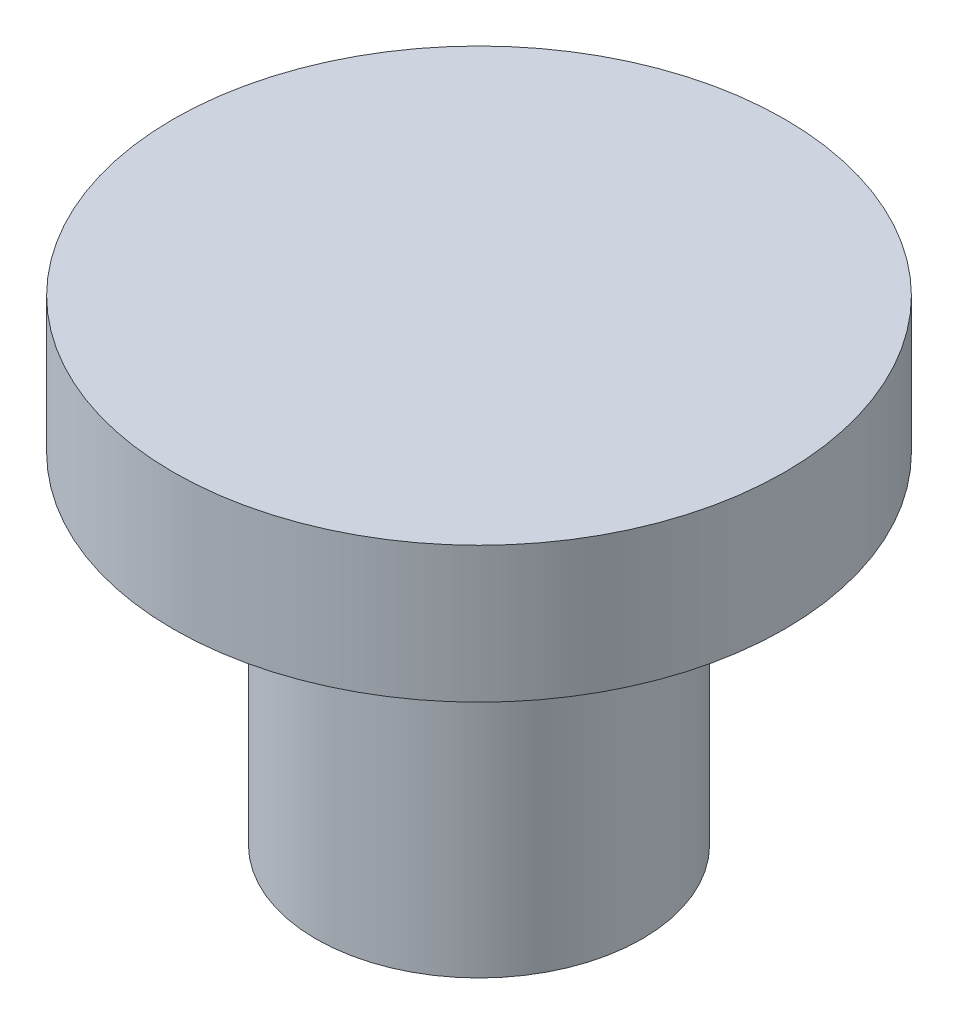
ISO-10303-21;
HEADER;
FILE_DESCRIPTION(('STEP AP214'),'2;1');
FILE_NAME('part.step','',(''),(''),'','','');
FILE_SCHEMA(('AUTOMOTIVE_DESIGN { 1 0 10303 214 1 1 1 1 }'));
ENDSEC;
DATA;
#1=APPLICATION_CONTEXT('core data for automotive mechanical design processes');
#2=APPLICATION_PROTOCOL_DEFINITION('international standard','automotive_design',2000,#1);
#3=PRODUCT_CONTEXT('',#1,'mechanical');
#4=PRODUCT('Part','Part','',(#3));
#5=PRODUCT_RELATED_PRODUCT_CATEGORY('part','',(#4));
#6=PRODUCT_DEFINITION_FORMATION('','',#4);
#7=PRODUCT_DEFINITION_CONTEXT('part definition',#1,'design');
#8=PRODUCT_DEFINITION('design','',#6,#7);
#9=PRODUCT_DEFINITION_SHAPE('','',#8);
#10=(LENGTH_UNIT() NAMED_UNIT(*) SI_UNIT(.MILLI.,.METRE.));
#11=(NAMED_UNIT(*) PLANE_ANGLE_UNIT() SI_UNIT($,.RADIAN.));
#12=(NAMED_UNIT(*) SI_UNIT($,.STERADIAN.) SOLID_ANGLE_UNIT());
#13=UNCERTAINTY_MEASURE_WITH_UNIT(LENGTH_MEASURE(1.E-05),#10,'distance_accuracy_value','');
#14=(GEOMETRIC_REPRESENTATION_CONTEXT(3) GLOBAL_UNCERTAINTY_ASSIGNED_CONTEXT((#13)) GLOBAL_UNIT_ASSIGNED_CONTEXT((#10,
#11,#12)) REPRESENTATION_CONTEXT('',''));
#15=CARTESIAN_POINT('',(0.,0.,0.));
#16=DIRECTION('',(0.,0.,1.));
#17=DIRECTION('',(1.,0.,0.));
#18=AXIS2_PLACEMENT_3D('',#15,#16,#17);
#19=CARTESIAN_POINT('',(0.,6.35,0.));
#20=DIRECTION('',(0.,-1.,0.));
#21=DIRECTION('',(0.,0.,-1.));
#22=AXIS2_PLACEMENT_3D('',#19,#20,#21);
#23=CYLINDRICAL_SURFACE('',#22,3.048);
#24=CARTESIAN_POINT('',(0.,6.35,0.));
#25=DIRECTION('',(0.,1.,0.));
#26=DIRECTION('',(0.,0.,1.));
#27=AXIS2_PLACEMENT_3D('',#24,#25,#26);
#28=CIRCLE('',#27,3.048);
#29=CARTESIAN_POINT('',(0.,6.35,3.048));
#30=VERTEX_POINT('',#29);
#31=EDGE_CURVE('E10',#30,#30,#28,.T.);
#32=ORIENTED_EDGE('',*,*,#31,.F.);
#33=EDGE_LOOP('',(#32));
#34=FACE_BOUND('',#33,.T.);
#35=CARTESIAN_POINT('',(0.,0.,0.));
#36=DIRECTION('',(0.,1.,0.));
#37=DIRECTION('',(0.,0.,1.));
#38=AXIS2_PLACEMENT_3D('',#35,#36,#37);
#39=CIRCLE('',#38,3.048);
#40=CARTESIAN_POINT('',(0.,0.,3.048));
#41=VERTEX_POINT('',#40);
#42=EDGE_CURVE('E37',#41,#41,#39,.T.);
#43=ORIENTED_EDGE('',*,*,#42,.T.);
#44=EDGE_LOOP('',(#43));
#45=FACE_BOUND('',#44,.T.);
#46=ADVANCED_FACE('F34',(#34,#45),#23,.T.);
#47=CARTESIAN_POINT('',(0.,0.,0.));
#48=DIRECTION('',(0.,1.,0.));
#49=DIRECTION('',(0.,0.,1.));
#50=AXIS2_PLACEMENT_3D('',#47,#48,#49);
#51=PLANE('',#50);
#52=ORIENTED_EDGE('',*,*,#42,.F.);
#53=EDGE_LOOP('',(#52));
#54=FACE_BOUND('',#53,.T.);
#55=ADVANCED_FACE('F57',(#54),#51,.F.);
#56=CARTESIAN_POINT('',(0.,8.89,0.));
#57=DIRECTION('',(0.,-1.,0.));
#58=DIRECTION('',(0.,0.,-1.));
#59=AXIS2_PLACEMENT_3D('',#56,#57,#58);
#60=CYLINDRICAL_SURFACE('',#59,5.715);
#61=CARTESIAN_POINT('',(0.,8.89,0.));
#62=DIRECTION('',(0.,1.,0.));
#63=DIRECTION('',(0.,0.,1.));
#64=AXIS2_PLACEMENT_3D('',#61,#62,#63);
#65=CIRCLE('',#64,5.715);
#66=CARTESIAN_POINT('',(0.,8.89,5.715));
#67=VERTEX_POINT('',#66);
#68=EDGE_CURVE('E44',#67,#67,#65,.T.);
#69=ORIENTED_EDGE('',*,*,#68,.F.);
#70=EDGE_LOOP('',(#69));
#71=FACE_BOUND('',#70,.T.);
#72=CARTESIAN_POINT('',(0.,6.35,0.));
#73=DIRECTION('',(0.,1.,0.));
#74=DIRECTION('',(0.,0.,1.));
#75=AXIS2_PLACEMENT_3D('',#72,#73,#74);
#76=CIRCLE('',#75,5.715);
#77=CARTESIAN_POINT('',(0.,6.35,5.715));
#78=VERTEX_POINT('',#77);
#79=EDGE_CURVE('E46',#78,#78,#76,.T.);
#80=ORIENTED_EDGE('',*,*,#79,.T.);
#81=EDGE_LOOP('',(#80));
#82=FACE_BOUND('',#81,.T.);
#83=ADVANCED_FACE('F54',(#71,#82),#60,.T.);
#84=CARTESIAN_POINT('',(0.,8.89,0.));
#85=DIRECTION('',(0.,1.,0.));
#86=DIRECTION('',(0.,0.,1.));
#87=AXIS2_PLACEMENT_3D('',#84,#85,#86);
#88=PLANE('',#87);
#89=ORIENTED_EDGE('',*,*,#68,.T.);
#90=EDGE_LOOP('',(#89));
#91=FACE_BOUND('',#90,.T.);
#92=ADVANCED_FACE('F52',(#91),#88,.T.);
#93=CARTESIAN_POINT('',(0.,6.35,0.));
#94=DIRECTION('',(0.,1.,0.));
#95=DIRECTION('',(0.,0.,1.));
#96=AXIS2_PLACEMENT_3D('',#93,#94,#95);
#97=PLANE('',#96);
#98=ORIENTED_EDGE('',*,*,#31,.T.);
#99=EDGE_LOOP('',(#98));
#100=FACE_BOUND('',#99,.T.);
#101=ORIENTED_EDGE('',*,*,#79,.F.);
#102=EDGE_LOOP('',(#101));
#103=FACE_BOUND('',#102,.T.);
#104=ADVANCED_FACE('F61',(#100,#103),#97,.F.);
#105=CLOSED_SHELL('',(#46,#55,#83,#92,#104));
#106=MANIFOLD_SOLID_BREP('B2',#105);
#107=ADVANCED_BREP_SHAPE_REPRESENTATION('',(#18,#106),#14);
#108=SHAPE_DEFINITION_REPRESENTATION(#9,#107);
ENDSEC;
END-ISO-10303-21;
